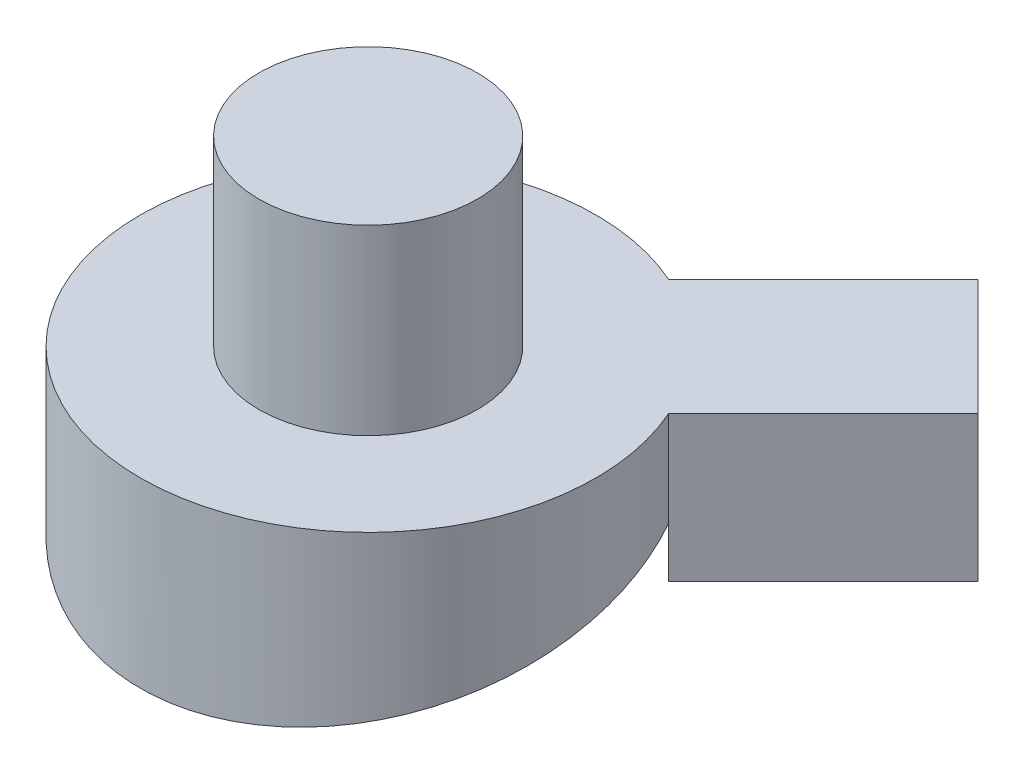
ISO-10303-21;
HEADER;
FILE_DESCRIPTION(('STEP AP214'),'2;1');
FILE_NAME('part.step','',(''),(''),'','','');
FILE_SCHEMA(('AUTOMOTIVE_DESIGN { 1 0 10303 214 1 1 1 1 }'));
ENDSEC;
DATA;
#1=APPLICATION_CONTEXT('core data for automotive mechanical design processes');
#2=APPLICATION_PROTOCOL_DEFINITION('international standard','automotive_design',2000,#1);
#3=PRODUCT_CONTEXT('',#1,'mechanical');
#4=PRODUCT('Part','Part','',(#3));
#5=PRODUCT_RELATED_PRODUCT_CATEGORY('part','',(#4));
#6=PRODUCT_DEFINITION_FORMATION('','',#4);
#7=PRODUCT_DEFINITION_CONTEXT('part definition',#1,'design');
#8=PRODUCT_DEFINITION('design','',#6,#7);
#9=PRODUCT_DEFINITION_SHAPE('','',#8);
#10=(LENGTH_UNIT() NAMED_UNIT(*) SI_UNIT(.MILLI.,.METRE.));
#11=(NAMED_UNIT(*) PLANE_ANGLE_UNIT() SI_UNIT($,.RADIAN.));
#12=(NAMED_UNIT(*) SI_UNIT($,.STERADIAN.) SOLID_ANGLE_UNIT());
#13=UNCERTAINTY_MEASURE_WITH_UNIT(LENGTH_MEASURE(1.E-05),#10,'distance_accuracy_value','');
#14=(GEOMETRIC_REPRESENTATION_CONTEXT(3) GLOBAL_UNCERTAINTY_ASSIGNED_CONTEXT((#13)) GLOBAL_UNIT_ASSIGNED_CONTEXT((#10,
#11,#12)) REPRESENTATION_CONTEXT('',''));
#15=CARTESIAN_POINT('',(0.,0.,0.));
#16=DIRECTION('',(0.,0.,1.));
#17=DIRECTION('',(1.,0.,0.));
#18=AXIS2_PLACEMENT_3D('',#15,#16,#17);
#19=CARTESIAN_POINT('',(0.,50.,0.));
#20=DIRECTION('',(0.,-1.,0.));
#21=DIRECTION('',(0.,0.,-1.));
#22=AXIS2_PLACEMENT_3D('',#19,#20,#21);
#23=CYLINDRICAL_SURFACE('',#22,62.5);
#24=CARTESIAN_POINT('',(0.,50.,0.));
#25=DIRECTION('',(0.,1.,0.));
#26=DIRECTION('',(0.,0.,1.));
#27=AXIS2_PLACEMENT_3D('',#24,#25,#26);
#28=CIRCLE('',#27,62.5);
#29=CARTESIAN_POINT('',(25.32115367948,50.,-57.1409588328736));
#30=VERTEX_POINT('',#29);
#31=CARTESIAN_POINT('',(57.1409588328742,50.,-25.3211536794786));
#32=VERTEX_POINT('',#31);
#33=EDGE_CURVE('E47',#30,#32,#28,.T.);
#34=ORIENTED_EDGE('',*,*,#33,.F.);
#35=DIRECTION('',(0.,1.,0.));
#36=VECTOR('',#35,1.);
#37=CARTESIAN_POINT('',(25.3211536794799,10.,-57.1409588328736));
#38=LINE('',#37,#36);
#39=CARTESIAN_POINT('',(25.3211536794799,32.5423408025416,-57.1409588328736));
#40=VERTEX_POINT('',#39);
#41=EDGE_CURVE('E124',#40,#30,#38,.T.);
#42=ORIENTED_EDGE('',*,*,#41,.F.);
#43=CARTESIAN_POINT('',(0.,17.,0.));
#44=DIRECTION('',(0.,0.964941743207845,0.262464154152534));
#45=DIRECTION('',(0.,-0.262464154152534,0.964941743207845));
#46=AXIS2_PLACEMENT_3D('',#43,#44,#45);
#47=ELLIPSE('',#46,64.7707495710834,62.5);
#48=CARTESIAN_POINT('',(57.1409588328742,23.8873538008182,-25.3211536794786));
#49=VERTEX_POINT('',#48);
#50=EDGE_CURVE('E135',#40,#49,#47,.T.);
#51=ORIENTED_EDGE('',*,*,#50,.T.);
#52=DIRECTION('',(0.,1.,0.));
#53=VECTOR('',#52,1.);
#54=CARTESIAN_POINT('',(57.1409588328742,10.,-25.3211536794786));
#55=LINE('',#54,#53);
#56=EDGE_CURVE('E59',#49,#32,#55,.T.);
#57=ORIENTED_EDGE('',*,*,#56,.T.);
#58=EDGE_LOOP('',(#34,#42,#51,#57));
#59=FACE_BOUND('',#58,.T.);
#60=ADVANCED_FACE('F39',(#59),#23,.T.);
#61=CARTESIAN_POINT('',(0.,50.,0.));
#62=DIRECTION('',(0.,1.,0.));
#63=DIRECTION('',(0.,0.,1.));
#64=AXIS2_PLACEMENT_3D('',#61,#62,#63);
#65=PLANE('',#64);
#66=CARTESIAN_POINT('',(0.,50.,0.));
#67=DIRECTION('',(0.,1.,0.));
#68=DIRECTION('',(0.,0.,1.));
#69=AXIS2_PLACEMENT_3D('',#66,#67,#68);
#70=CIRCLE('',#69,30.);
#71=CARTESIAN_POINT('',(0.,50.,30.));
#72=VERTEX_POINT('',#71);
#73=EDGE_CURVE('E11',#72,#72,#70,.T.);
#74=ORIENTED_EDGE('',*,*,#73,.F.);
#75=EDGE_LOOP('',(#74));
#76=FACE_BOUND('',#75,.T.);
#77=ORIENTED_EDGE('',*,*,#33,.T.);
#78=DIRECTION('',(0.707106781186548,0.,-0.707106781186548));
#79=VECTOR('',#78,1.);
#80=CARTESIAN_POINT('',(99.5673657040671,50.,-67.7475605506715));
#81=LINE('',#80,#79);
#82=CARTESIAN_POINT('',(99.5673657040671,50.,-67.7475605506715));
#83=VERTEX_POINT('',#82);
#84=EDGE_CURVE('E117',#32,#83,#81,.T.);
#85=ORIENTED_EDGE('',*,*,#84,.T.);
#86=DIRECTION('',(-0.707106781186548,0.,-0.707106781186547));
#87=VECTOR('',#86,1.);
#88=CARTESIAN_POINT('',(67.7475605506724,50.,-99.5673657040661));
#89=LINE('',#88,#87);
#90=CARTESIAN_POINT('',(67.7475605506724,50.,-99.5673657040661));
#91=VERTEX_POINT('',#90);
#92=EDGE_CURVE('E111',#83,#91,#89,.T.);
#93=ORIENTED_EDGE('',*,*,#92,.T.);
#94=DIRECTION('',(-0.707106781186547,0.,0.707106781186547));
#95=VECTOR('',#94,1.);
#96=CARTESIAN_POINT('',(25.3211536794799,50.,-57.1409588328736));
#97=LINE('',#96,#95);
#98=EDGE_CURVE('E108',#91,#30,#97,.T.);
#99=ORIENTED_EDGE('',*,*,#98,.T.);
#100=EDGE_LOOP('',(#77,#85,#93,#99));
#101=FACE_BOUND('',#100,.T.);
#102=ADVANCED_FACE('F139',(#76,#101),#65,.T.);
#103=CARTESIAN_POINT('',(-62.5,0.,62.5));
#104=DIRECTION('',(0.,0.964941743207845,0.262464154152534));
#105=DIRECTION('',(0.,-0.262464154152534,0.964941743207845));
#106=AXIS2_PLACEMENT_3D('',#103,#104,#105);
#107=PLANE('',#106);
#108=CARTESIAN_POINT('',(0.,17.,0.));
#109=DIRECTION('',(0.,0.964941743207845,0.262464154152534));
#110=DIRECTION('',(0.,-0.262464154152534,0.964941743207845));
#111=AXIS2_PLACEMENT_3D('',#108,#109,#110);
#112=CIRCLE('',#111,50.);
#113=CARTESIAN_POINT('',(0.,3.87679229237331,48.2470871603923));
#114=VERTEX_POINT('',#113);
#115=EDGE_CURVE('E42',#114,#114,#112,.F.);
#116=ORIENTED_EDGE('',*,*,#115,.F.);
#117=EDGE_LOOP('',(#116));
#118=FACE_BOUND('',#117,.T.);
#119=EDGE_CURVE('E137',#49,#40,#47,.T.);
#120=ORIENTED_EDGE('',*,*,#119,.F.);
#121=ORIENTED_EDGE('',*,*,#50,.F.);
#122=EDGE_LOOP('',(#120,#121));
#123=FACE_BOUND('',#122,.T.);
#124=ADVANCED_FACE('F148',(#118,#123),#107,.F.);
#125=CARTESIAN_POINT('',(0.,100.,0.));
#126=DIRECTION('',(0.,-1.,0.));
#127=DIRECTION('',(0.,0.,-1.));
#128=AXIS2_PLACEMENT_3D('',#125,#126,#127);
#129=CYLINDRICAL_SURFACE('',#128,30.);
#130=CARTESIAN_POINT('',(0.,100.,0.));
#131=DIRECTION('',(0.,1.,0.));
#132=DIRECTION('',(0.,0.,1.));
#133=AXIS2_PLACEMENT_3D('',#130,#131,#132);
#134=CIRCLE('',#133,30.);
#135=CARTESIAN_POINT('',(0.,100.,30.));
#136=VERTEX_POINT('',#135);
#137=EDGE_CURVE('E133',#136,#136,#134,.T.);
#138=ORIENTED_EDGE('',*,*,#137,.F.);
#139=EDGE_LOOP('',(#138));
#140=FACE_BOUND('',#139,.T.);
#141=ORIENTED_EDGE('',*,*,#73,.T.);
#142=EDGE_LOOP('',(#141));
#143=FACE_BOUND('',#142,.T.);
#144=ADVANCED_FACE('F150',(#140,#143),#129,.T.);
#145=CARTESIAN_POINT('',(0.,100.,0.));
#146=DIRECTION('',(0.,1.,0.));
#147=DIRECTION('',(0.,0.,1.));
#148=AXIS2_PLACEMENT_3D('',#145,#146,#147);
#149=PLANE('',#148);
#150=ORIENTED_EDGE('',*,*,#137,.T.);
#151=EDGE_LOOP('',(#150));
#152=FACE_BOUND('',#151,.T.);
#153=ADVANCED_FACE('F158',(#152),#149,.T.);
#154=CARTESIAN_POINT('',(0.,-14.6578273046898,-8.61092902687564));
#155=DIRECTION('',(0.,0.964941743207845,0.262464154152534));
#156=DIRECTION('',(0.,-0.262464154152534,0.964941743207845));
#157=AXIS2_PLACEMENT_3D('',#154,#155,#156);
#158=CYLINDRICAL_SURFACE('',#157,50.);
#159=CARTESIAN_POINT('',(0.,26.6494174320785,2.62464154152534));
#160=DIRECTION('',(0.,-0.964941743207845,-0.262464154152534));
#161=DIRECTION('',(0.,0.262464154152534,-0.964941743207845));
#162=AXIS2_PLACEMENT_3D('',#159,#160,#161);
#163=CIRCLE('',#162,50.);
#164=CARTESIAN_POINT('',(0.,39.7726251397052,-45.6224456188669));
#165=VERTEX_POINT('',#164);
#166=EDGE_CURVE('E130',#165,#165,#163,.T.);
#167=ORIENTED_EDGE('',*,*,#166,.F.);
#168=EDGE_LOOP('',(#167));
#169=FACE_BOUND('',#168,.T.);
#170=ORIENTED_EDGE('',*,*,#115,.T.);
#171=EDGE_LOOP('',(#170));
#172=FACE_BOUND('',#171,.T.);
#173=ADVANCED_FACE('F230',(#169,#172),#158,.F.);
#174=CARTESIAN_POINT('',(0.,14.0627173336753,1.27372310103436));
#175=DIRECTION('',(0.,0.964941743207845,0.262464154152534));
#176=DIRECTION('',(0.,-0.262464154152534,0.964941743207845));
#177=AXIS2_PLACEMENT_3D('',#174,#175,#176);
#178=PLANE('',#177);
#179=CARTESIAN_POINT('',(0.,14.5876456419804,-0.656160385381336));
#180=DIRECTION('',(0.,-0.964941743207845,-0.262464154152534));
#181=DIRECTION('',(0.,0.262464154152534,-0.964941743207845));
#182=AXIS2_PLACEMENT_3D('',#179,#180,#181);
#183=CIRCLE('',#182,2.);
#184=CARTESIAN_POINT('',(0.,15.1125739502855,-2.58604387179703));
#185=VERTEX_POINT('',#184);
#186=EDGE_CURVE('E123',#185,#185,#183,.T.);
#187=ORIENTED_EDGE('',*,*,#186,.T.);
#188=EDGE_LOOP('',(#187));
#189=FACE_BOUND('',#188,.T.);
#190=ADVANCED_FACE('F227',(#189),#178,.F.);
#191=CARTESIAN_POINT('',(0.,26.6494174320785,2.62464154152535));
#192=DIRECTION('',(0.,0.964941743207845,0.262464154152534));
#193=DIRECTION('',(0.,-0.262464154152534,0.964941743207845));
#194=AXIS2_PLACEMENT_3D('',#191,#192,#193);
#195=CONICAL_SURFACE('',#194,50.,1.316038024359);
#196=ORIENTED_EDGE('',*,*,#186,.F.);
#197=EDGE_LOOP('',(#196));
#198=FACE_BOUND('',#197,.T.);
#199=ORIENTED_EDGE('',*,*,#166,.T.);
#200=EDGE_LOOP('',(#199));
#201=FACE_BOUND('',#200,.T.);
#202=ADVANCED_FACE('F171',(#198,#201),#195,.T.);
#203=CARTESIAN_POINT('',(0.,10.,0.));
#204=DIRECTION('',(0.,1.,0.));
#205=DIRECTION('',(0.,0.,1.));
#206=AXIS2_PLACEMENT_3D('',#203,#204,#205);
#207=CYLINDRICAL_SURFACE('',#206,62.5);
#208=ORIENTED_EDGE('',*,*,#119,.T.);
#209=CARTESIAN_POINT('',(25.3211536794799,10.,-57.1409588328736));
#210=VERTEX_POINT('',#209);
#211=EDGE_CURVE('E107',#210,#40,#38,.T.);
#212=ORIENTED_EDGE('',*,*,#211,.F.);
#213=CARTESIAN_POINT('',(0.,10.,0.));
#214=DIRECTION('',(0.,-1.,0.));
#215=DIRECTION('',(0.,0.,1.));
#216=AXIS2_PLACEMENT_3D('',#213,#214,#215);
#217=CIRCLE('',#216,62.5);
#218=CARTESIAN_POINT('',(57.1409588328742,10.,-25.3211536794786));
#219=VERTEX_POINT('',#218);
#220=EDGE_CURVE('E100',#210,#219,#217,.T.);
#221=ORIENTED_EDGE('',*,*,#220,.T.);
#222=EDGE_CURVE('E85',#219,#49,#55,.T.);
#223=ORIENTED_EDGE('',*,*,#222,.T.);
#224=EDGE_LOOP('',(#208,#212,#221,#223));
#225=FACE_BOUND('',#224,.T.);
#226=ADVANCED_FACE('F105',(#225),#207,.F.);
#227=CARTESIAN_POINT('',(25.3211536794799,10.,-57.1409588328736));
#228=DIRECTION('',(-0.707106781186548,0.,-0.707106781186548));
#229=DIRECTION('',(-0.707106781186548,0.,0.707106781186548));
#230=AXIS2_PLACEMENT_3D('',#227,#228,#229);
#231=PLANE('',#230);
#232=ORIENTED_EDGE('',*,*,#98,.F.);
#233=DIRECTION('',(0.,1.,0.));
#234=VECTOR('',#233,1.);
#235=CARTESIAN_POINT('',(67.7475605506724,10.,-99.5673657040661));
#236=LINE('',#235,#234);
#237=CARTESIAN_POINT('',(67.7475605506724,10.,-99.5673657040661));
#238=VERTEX_POINT('',#237);
#239=EDGE_CURVE('E125',#238,#91,#236,.T.);
#240=ORIENTED_EDGE('',*,*,#239,.F.);
#241=DIRECTION('',(-0.707106781186547,0.,0.707106781186547));
#242=VECTOR('',#241,1.);
#243=CARTESIAN_POINT('',(25.3211536794799,10.,-57.1409588328736));
#244=LINE('',#243,#242);
#245=EDGE_CURVE('E115',#238,#210,#244,.T.);
#246=ORIENTED_EDGE('',*,*,#245,.T.);
#247=ORIENTED_EDGE('',*,*,#211,.T.);
#248=ORIENTED_EDGE('',*,*,#41,.T.);
#249=EDGE_LOOP('',(#232,#240,#246,#247,#248));
#250=FACE_BOUND('',#249,.T.);
#251=ADVANCED_FACE('F145',(#250),#231,.T.);
#252=CARTESIAN_POINT('',(67.7475605506724,10.,-99.5673657040661));
#253=DIRECTION('',(0.707106781186547,0.,-0.707106781186548));
#254=DIRECTION('',(-0.707106781186548,0.,-0.707106781186547));
#255=AXIS2_PLACEMENT_3D('',#252,#253,#254);
#256=PLANE('',#255);
#257=ORIENTED_EDGE('',*,*,#92,.F.);
#258=DIRECTION('',(0.,1.,0.));
#259=VECTOR('',#258,1.);
#260=CARTESIAN_POINT('',(99.5673657040671,10.,-67.7475605506715));
#261=LINE('',#260,#259);
#262=CARTESIAN_POINT('',(99.5673657040671,10.,-67.7475605506715));
#263=VERTEX_POINT('',#262);
#264=EDGE_CURVE('E93',#263,#83,#261,.T.);
#265=ORIENTED_EDGE('',*,*,#264,.F.);
#266=DIRECTION('',(-0.707106781186548,0.,-0.707106781186547));
#267=VECTOR('',#266,1.);
#268=CARTESIAN_POINT('',(67.7475605506724,10.,-99.5673657040661));
#269=LINE('',#268,#267);
#270=EDGE_CURVE('E103',#263,#238,#269,.T.);
#271=ORIENTED_EDGE('',*,*,#270,.T.);
#272=ORIENTED_EDGE('',*,*,#239,.T.);
#273=EDGE_LOOP('',(#257,#265,#271,#272));
#274=FACE_BOUND('',#273,.T.);
#275=ADVANCED_FACE('F143',(#274),#256,.T.);
#276=CARTESIAN_POINT('',(99.5673657040671,10.,-67.7475605506715));
#277=DIRECTION('',(0.707106781186548,0.,0.707106781186548));
#278=DIRECTION('',(0.707106781186548,0.,-0.707106781186548));
#279=AXIS2_PLACEMENT_3D('',#276,#277,#278);
#280=PLANE('',#279);
#281=ORIENTED_EDGE('',*,*,#84,.F.);
#282=ORIENTED_EDGE('',*,*,#56,.F.);
#283=ORIENTED_EDGE('',*,*,#222,.F.);
#284=DIRECTION('',(0.707106781186548,0.,-0.707106781186548));
#285=VECTOR('',#284,1.);
#286=CARTESIAN_POINT('',(99.5673657040671,10.,-67.7475605506715));
#287=LINE('',#286,#285);
#288=EDGE_CURVE('E89',#219,#263,#287,.T.);
#289=ORIENTED_EDGE('',*,*,#288,.T.);
#290=ORIENTED_EDGE('',*,*,#264,.T.);
#291=EDGE_LOOP('',(#281,#282,#283,#289,#290));
#292=FACE_BOUND('',#291,.T.);
#293=ADVANCED_FACE('F88',(#292),#280,.T.);
#294=CARTESIAN_POINT('',(0.,10.,0.));
#295=DIRECTION('',(0.,1.,0.));
#296=DIRECTION('',(0.,0.,1.));
#297=AXIS2_PLACEMENT_3D('',#294,#295,#296);
#298=PLANE('',#297);
#299=ORIENTED_EDGE('',*,*,#220,.F.);
#300=ORIENTED_EDGE('',*,*,#245,.F.);
#301=ORIENTED_EDGE('',*,*,#270,.F.);
#302=ORIENTED_EDGE('',*,*,#288,.F.);
#303=EDGE_LOOP('',(#299,#300,#301,#302));
#304=FACE_BOUND('',#303,.T.);
#305=ADVANCED_FACE('F98',(#304),#298,.F.);
#306=CLOSED_SHELL('',(#60,#102,#124,#144,#153,#173,#190,#202,#226,#251,#275,#293,#305));
#307=MANIFOLD_SOLID_BREP('B2',#306);
#308=ADVANCED_BREP_SHAPE_REPRESENTATION('',(#18,#307),#14);
#309=SHAPE_DEFINITION_REPRESENTATION(#9,#308);
ENDSEC;
END-ISO-10303-21;
